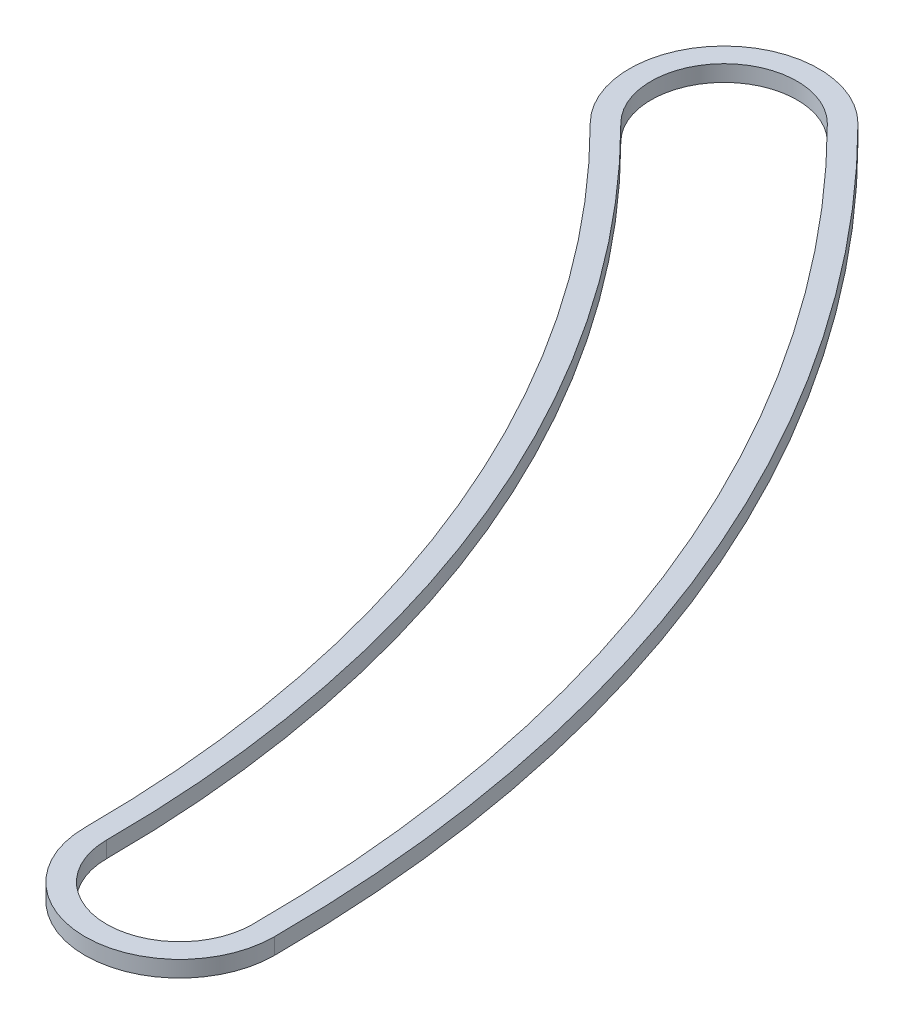
ISO-10303-21;
HEADER;
FILE_DESCRIPTION(('STEP AP214'),'2;1');
FILE_NAME('part.step','',(''),(''),'','','');
FILE_SCHEMA(('AUTOMOTIVE_DESIGN { 1 0 10303 214 1 1 1 1 }'));
ENDSEC;
DATA;
#1=APPLICATION_CONTEXT('core data for automotive mechanical design processes');
#2=APPLICATION_PROTOCOL_DEFINITION('international standard','automotive_design',2000,#1);
#3=PRODUCT_CONTEXT('',#1,'mechanical');
#4=PRODUCT('Part','Part','',(#3));
#5=PRODUCT_RELATED_PRODUCT_CATEGORY('part','',(#4));
#6=PRODUCT_DEFINITION_FORMATION('','',#4);
#7=PRODUCT_DEFINITION_CONTEXT('part definition',#1,'design');
#8=PRODUCT_DEFINITION('design','',#6,#7);
#9=PRODUCT_DEFINITION_SHAPE('','',#8);
#10=(LENGTH_UNIT() NAMED_UNIT(*) SI_UNIT(.MILLI.,.METRE.));
#11=(NAMED_UNIT(*) PLANE_ANGLE_UNIT() SI_UNIT($,.RADIAN.));
#12=(NAMED_UNIT(*) SI_UNIT($,.STERADIAN.) SOLID_ANGLE_UNIT());
#13=UNCERTAINTY_MEASURE_WITH_UNIT(LENGTH_MEASURE(1.E-05),#10,'distance_accuracy_value','');
#14=(GEOMETRIC_REPRESENTATION_CONTEXT(3) GLOBAL_UNCERTAINTY_ASSIGNED_CONTEXT((#13)) GLOBAL_UNIT_ASSIGNED_CONTEXT((#10,
#11,#12)) REPRESENTATION_CONTEXT('',''));
#15=CARTESIAN_POINT('',(0.,0.,0.));
#16=DIRECTION('',(0.,0.,1.));
#17=DIRECTION('',(1.,0.,0.));
#18=AXIS2_PLACEMENT_3D('',#15,#16,#17);
#19=CARTESIAN_POINT('',(30.861,0.762,0.));
#20=DIRECTION('',(0.,1.,0.));
#21=DIRECTION('',(0.,0.,1.));
#22=AXIS2_PLACEMENT_3D('',#19,#20,#21);
#23=PLANE('',#22);
#24=CARTESIAN_POINT('',(61.722,0.762,0.));
#25=DIRECTION('',(0.,1.,0.));
#26=DIRECTION('',(0.,0.,1.));
#27=AXIS2_PLACEMENT_3D('',#24,#25,#26);
#28=CIRCLE('',#27,4.445);
#29=CARTESIAN_POINT('',(57.277,0.762,0.));
#30=VERTEX_POINT('',#29);
#31=CARTESIAN_POINT('',(66.167,0.762,0.));
#32=VERTEX_POINT('',#31);
#33=EDGE_CURVE('E153',#30,#32,#28,.T.);
#34=ORIENTED_EDGE('',*,*,#33,.T.);
#35=CARTESIAN_POINT('',(0.,0.762,0.));
#36=DIRECTION('',(0.,1.,0.));
#37=DIRECTION('',(0.,0.,1.));
#38=AXIS2_PLACEMENT_3D('',#35,#36,#37);
#39=CIRCLE('',#38,66.167);
#40=CARTESIAN_POINT('',(46.7871343907702,0.762,-46.7871343907704));
#41=VERTEX_POINT('',#40);
#42=EDGE_CURVE('E157',#32,#41,#39,.T.);
#43=ORIENTED_EDGE('',*,*,#42,.T.);
#44=CARTESIAN_POINT('',(43.644044748396,0.762,-43.6440447483962));
#45=DIRECTION('',(0.,1.,0.));
#46=DIRECTION('',(0.,0.,1.));
#47=AXIS2_PLACEMENT_3D('',#44,#45,#46);
#48=CIRCLE('',#47,4.445);
#49=CARTESIAN_POINT('',(40.5009551060218,0.762,-40.500955106022));
#50=VERTEX_POINT('',#49);
#51=EDGE_CURVE('E161',#41,#50,#48,.T.);
#52=ORIENTED_EDGE('',*,*,#51,.T.);
#53=CARTESIAN_POINT('',(0.,0.762,0.));
#54=DIRECTION('',(0.,-1.,0.));
#55=DIRECTION('',(0.,0.,1.));
#56=AXIS2_PLACEMENT_3D('',#53,#54,#55);
#57=CIRCLE('',#56,57.277);
#58=EDGE_CURVE('E164',#50,#30,#57,.T.);
#59=ORIENTED_EDGE('',*,*,#58,.T.);
#60=EDGE_LOOP('',(#34,#43,#52,#59));
#61=FACE_BOUND('',#60,.T.);
#62=CARTESIAN_POINT('',(0.,0.762,0.));
#63=DIRECTION('',(0.,1.,0.));
#64=DIRECTION('',(0.,0.,1.));
#65=AXIS2_PLACEMENT_3D('',#62,#63,#64);
#66=CIRCLE('',#65,65.151);
#67=CARTESIAN_POINT('',(65.151,0.762,0.));
#68=VERTEX_POINT('',#67);
#69=CARTESIAN_POINT('',(46.0687139010846,0.762,-46.0687139010848));
#70=VERTEX_POINT('',#69);
#71=EDGE_CURVE('E114',#68,#70,#66,.T.);
#72=ORIENTED_EDGE('',*,*,#71,.F.);
#73=CARTESIAN_POINT('',(61.722,0.762,0.));
#74=DIRECTION('',(0.,1.,0.));
#75=DIRECTION('',(0.,0.,1.));
#76=AXIS2_PLACEMENT_3D('',#73,#74,#75);
#77=CIRCLE('',#76,3.429);
#78=CARTESIAN_POINT('',(58.293,0.762,0.));
#79=VERTEX_POINT('',#78);
#80=EDGE_CURVE('E105',#79,#68,#77,.T.);
#81=ORIENTED_EDGE('',*,*,#80,.F.);
#82=CARTESIAN_POINT('',(0.,0.762,0.));
#83=DIRECTION('',(0.,-1.,0.));
#84=DIRECTION('',(0.,0.,1.));
#85=AXIS2_PLACEMENT_3D('',#82,#83,#84);
#86=CIRCLE('',#85,58.293);
#87=CARTESIAN_POINT('',(41.2193755957073,0.762,-41.2193755957075));
#88=VERTEX_POINT('',#87);
#89=EDGE_CURVE('E131',#88,#79,#86,.T.);
#90=ORIENTED_EDGE('',*,*,#89,.F.);
#91=CARTESIAN_POINT('',(43.644044748396,0.762,-43.6440447483962));
#92=DIRECTION('',(0.,1.,0.));
#93=DIRECTION('',(0.,0.,1.));
#94=AXIS2_PLACEMENT_3D('',#91,#92,#93);
#95=CIRCLE('',#94,3.429);
#96=EDGE_CURVE('E127',#70,#88,#95,.T.);
#97=ORIENTED_EDGE('',*,*,#96,.F.);
#98=EDGE_LOOP('',(#72,#81,#90,#97));
#99=FACE_BOUND('',#98,.T.);
#100=ADVANCED_FACE('F39',(#61,#99),#23,.T.);
#101=CARTESIAN_POINT('',(30.861,0.,0.));
#102=DIRECTION('',(0.,1.,0.));
#103=DIRECTION('',(0.,0.,1.));
#104=AXIS2_PLACEMENT_3D('',#101,#102,#103);
#105=PLANE('',#104);
#106=CARTESIAN_POINT('',(61.722,0.,0.));
#107=DIRECTION('',(0.,1.,0.));
#108=DIRECTION('',(0.,0.,1.));
#109=AXIS2_PLACEMENT_3D('',#106,#107,#108);
#110=CIRCLE('',#109,4.445);
#111=CARTESIAN_POINT('',(57.277,0.,0.));
#112=VERTEX_POINT('',#111);
#113=CARTESIAN_POINT('',(66.167,0.,0.));
#114=VERTEX_POINT('',#113);
#115=EDGE_CURVE('E123',#112,#114,#110,.T.);
#116=ORIENTED_EDGE('',*,*,#115,.F.);
#117=CARTESIAN_POINT('',(0.,0.,0.));
#118=DIRECTION('',(0.,-1.,0.));
#119=DIRECTION('',(0.,0.,1.));
#120=AXIS2_PLACEMENT_3D('',#117,#118,#119);
#121=CIRCLE('',#120,57.277);
#122=CARTESIAN_POINT('',(40.5009551060218,0.,-40.500955106022));
#123=VERTEX_POINT('',#122);
#124=EDGE_CURVE('E158',#123,#112,#121,.T.);
#125=ORIENTED_EDGE('',*,*,#124,.F.);
#126=CARTESIAN_POINT('',(43.644044748396,0.,-43.6440447483962));
#127=DIRECTION('',(0.,1.,0.));
#128=DIRECTION('',(0.,0.,1.));
#129=AXIS2_PLACEMENT_3D('',#126,#127,#128);
#130=CIRCLE('',#129,4.445);
#131=CARTESIAN_POINT('',(46.7871343907702,0.,-46.7871343907704));
#132=VERTEX_POINT('',#131);
#133=EDGE_CURVE('E174',#132,#123,#130,.T.);
#134=ORIENTED_EDGE('',*,*,#133,.F.);
#135=CARTESIAN_POINT('',(0.,0.,0.));
#136=DIRECTION('',(0.,1.,0.));
#137=DIRECTION('',(0.,0.,1.));
#138=AXIS2_PLACEMENT_3D('',#135,#136,#137);
#139=CIRCLE('',#138,66.167);
#140=EDGE_CURVE('E171',#114,#132,#139,.T.);
#141=ORIENTED_EDGE('',*,*,#140,.F.);
#142=EDGE_LOOP('',(#116,#125,#134,#141));
#143=FACE_BOUND('',#142,.T.);
#144=CARTESIAN_POINT('',(61.722,0.,0.));
#145=DIRECTION('',(0.,1.,0.));
#146=DIRECTION('',(0.,0.,1.));
#147=AXIS2_PLACEMENT_3D('',#144,#145,#146);
#148=CIRCLE('',#147,3.429);
#149=CARTESIAN_POINT('',(58.293,0.,0.));
#150=VERTEX_POINT('',#149);
#151=CARTESIAN_POINT('',(65.151,0.,0.));
#152=VERTEX_POINT('',#151);
#153=EDGE_CURVE('E63',#150,#152,#148,.T.);
#154=ORIENTED_EDGE('',*,*,#153,.T.);
#155=CARTESIAN_POINT('',(0.,0.,0.));
#156=DIRECTION('',(0.,1.,0.));
#157=DIRECTION('',(0.,0.,1.));
#158=AXIS2_PLACEMENT_3D('',#155,#156,#157);
#159=CIRCLE('',#158,65.151);
#160=CARTESIAN_POINT('',(46.0687139010846,0.,-46.0687139010848));
#161=VERTEX_POINT('',#160);
#162=EDGE_CURVE('E121',#152,#161,#159,.T.);
#163=ORIENTED_EDGE('',*,*,#162,.T.);
#164=CARTESIAN_POINT('',(43.644044748396,0.,-43.6440447483962));
#165=DIRECTION('',(0.,1.,0.));
#166=DIRECTION('',(0.,0.,1.));
#167=AXIS2_PLACEMENT_3D('',#164,#165,#166);
#168=CIRCLE('',#167,3.429);
#169=CARTESIAN_POINT('',(41.2193755957073,0.,-41.2193755957075));
#170=VERTEX_POINT('',#169);
#171=EDGE_CURVE('E140',#161,#170,#168,.T.);
#172=ORIENTED_EDGE('',*,*,#171,.T.);
#173=CARTESIAN_POINT('',(0.,0.,0.));
#174=DIRECTION('',(0.,-1.,0.));
#175=DIRECTION('',(0.,0.,1.));
#176=AXIS2_PLACEMENT_3D('',#173,#174,#175);
#177=CIRCLE('',#176,58.293);
#178=EDGE_CURVE('E115',#170,#150,#177,.T.);
#179=ORIENTED_EDGE('',*,*,#178,.T.);
#180=EDGE_LOOP('',(#154,#163,#172,#179));
#181=FACE_BOUND('',#180,.T.);
#182=ADVANCED_FACE('F197',(#143,#181),#105,.F.);
#183=CARTESIAN_POINT('',(61.722,0.762,0.));
#184=DIRECTION('',(0.,-1.,0.));
#185=DIRECTION('',(0.,0.,-1.));
#186=AXIS2_PLACEMENT_3D('',#183,#184,#185);
#187=CYLINDRICAL_SURFACE('',#186,4.445);
#188=ORIENTED_EDGE('',*,*,#115,.T.);
#189=DIRECTION('',(0.,-1.,0.));
#190=VECTOR('',#189,1.);
#191=CARTESIAN_POINT('',(66.167,0.762,0.));
#192=LINE('',#191,#190);
#193=EDGE_CURVE('E11',#32,#114,#192,.T.);
#194=ORIENTED_EDGE('',*,*,#193,.F.);
#195=ORIENTED_EDGE('',*,*,#33,.F.);
#196=DIRECTION('',(0.,-1.,0.));
#197=VECTOR('',#196,1.);
#198=CARTESIAN_POINT('',(57.277,0.762,0.));
#199=LINE('',#198,#197);
#200=EDGE_CURVE('E167',#30,#112,#199,.T.);
#201=ORIENTED_EDGE('',*,*,#200,.T.);
#202=EDGE_LOOP('',(#188,#194,#195,#201));
#203=FACE_BOUND('',#202,.T.);
#204=ADVANCED_FACE('F41',(#203),#187,.T.);
#205=CARTESIAN_POINT('',(0.,0.762,0.));
#206=DIRECTION('',(0.,-1.,0.));
#207=DIRECTION('',(0.,0.,-1.));
#208=AXIS2_PLACEMENT_3D('',#205,#206,#207);
#209=CYLINDRICAL_SURFACE('',#208,66.167);
#210=ORIENTED_EDGE('',*,*,#140,.T.);
#211=DIRECTION('',(0.,-1.,0.));
#212=VECTOR('',#211,1.);
#213=CARTESIAN_POINT('',(46.7871343907702,0.762,-46.7871343907704));
#214=LINE('',#213,#212);
#215=EDGE_CURVE('E48',#41,#132,#214,.T.);
#216=ORIENTED_EDGE('',*,*,#215,.F.);
#217=ORIENTED_EDGE('',*,*,#42,.F.);
#218=ORIENTED_EDGE('',*,*,#193,.T.);
#219=EDGE_LOOP('',(#210,#216,#217,#218));
#220=FACE_BOUND('',#219,.T.);
#221=ADVANCED_FACE('F207',(#220),#209,.T.);
#222=CARTESIAN_POINT('',(43.644044748396,0.762,-43.6440447483962));
#223=DIRECTION('',(0.,-1.,0.));
#224=DIRECTION('',(0.,0.,-1.));
#225=AXIS2_PLACEMENT_3D('',#222,#223,#224);
#226=CYLINDRICAL_SURFACE('',#225,4.445);
#227=ORIENTED_EDGE('',*,*,#133,.T.);
#228=DIRECTION('',(0.,-1.,0.));
#229=VECTOR('',#228,1.);
#230=CARTESIAN_POINT('',(40.5009551060218,0.762,-40.500955106022));
#231=LINE('',#230,#229);
#232=EDGE_CURVE('E182',#50,#123,#231,.T.);
#233=ORIENTED_EDGE('',*,*,#232,.F.);
#234=ORIENTED_EDGE('',*,*,#51,.F.);
#235=ORIENTED_EDGE('',*,*,#215,.T.);
#236=EDGE_LOOP('',(#227,#233,#234,#235));
#237=FACE_BOUND('',#236,.T.);
#238=ADVANCED_FACE('F191',(#237),#226,.T.);
#239=CARTESIAN_POINT('',(0.,0.762,0.));
#240=DIRECTION('',(0.,-1.,0.));
#241=DIRECTION('',(0.,0.,-1.));
#242=AXIS2_PLACEMENT_3D('',#239,#240,#241);
#243=CYLINDRICAL_SURFACE('',#242,57.277);
#244=ORIENTED_EDGE('',*,*,#124,.T.);
#245=ORIENTED_EDGE('',*,*,#200,.F.);
#246=ORIENTED_EDGE('',*,*,#58,.F.);
#247=ORIENTED_EDGE('',*,*,#232,.T.);
#248=EDGE_LOOP('',(#244,#245,#246,#247));
#249=FACE_BOUND('',#248,.T.);
#250=ADVANCED_FACE('F201',(#249),#243,.F.);
#251=CARTESIAN_POINT('',(61.722,0.762,0.));
#252=DIRECTION('',(0.,-1.,0.));
#253=DIRECTION('',(0.,0.,-1.));
#254=AXIS2_PLACEMENT_3D('',#251,#252,#253);
#255=CYLINDRICAL_SURFACE('',#254,3.429);
#256=ORIENTED_EDGE('',*,*,#153,.F.);
#257=DIRECTION('',(0.,-1.,0.));
#258=VECTOR('',#257,1.);
#259=CARTESIAN_POINT('',(58.293,0.762,0.));
#260=LINE('',#259,#258);
#261=EDGE_CURVE('E109',#79,#150,#260,.T.);
#262=ORIENTED_EDGE('',*,*,#261,.F.);
#263=ORIENTED_EDGE('',*,*,#80,.T.);
#264=DIRECTION('',(0.,-1.,0.));
#265=VECTOR('',#264,1.);
#266=CARTESIAN_POINT('',(65.151,0.762,0.));
#267=LINE('',#266,#265);
#268=EDGE_CURVE('E108',#68,#152,#267,.T.);
#269=ORIENTED_EDGE('',*,*,#268,.T.);
#270=EDGE_LOOP('',(#256,#262,#263,#269));
#271=FACE_BOUND('',#270,.T.);
#272=ADVANCED_FACE('F107',(#271),#255,.F.);
#273=CARTESIAN_POINT('',(0.,0.762,0.));
#274=DIRECTION('',(0.,-1.,0.));
#275=DIRECTION('',(0.,0.,-1.));
#276=AXIS2_PLACEMENT_3D('',#273,#274,#275);
#277=CYLINDRICAL_SURFACE('',#276,65.151);
#278=ORIENTED_EDGE('',*,*,#162,.F.);
#279=ORIENTED_EDGE('',*,*,#268,.F.);
#280=ORIENTED_EDGE('',*,*,#71,.T.);
#281=DIRECTION('',(0.,-1.,0.));
#282=VECTOR('',#281,1.);
#283=CARTESIAN_POINT('',(46.0687139010846,0.762,-46.0687139010848));
#284=LINE('',#283,#282);
#285=EDGE_CURVE('E124',#70,#161,#284,.T.);
#286=ORIENTED_EDGE('',*,*,#285,.T.);
#287=EDGE_LOOP('',(#278,#279,#280,#286));
#288=FACE_BOUND('',#287,.T.);
#289=ADVANCED_FACE('F118',(#288),#277,.F.);
#290=CARTESIAN_POINT('',(43.644044748396,0.762,-43.6440447483962));
#291=DIRECTION('',(0.,-1.,0.));
#292=DIRECTION('',(0.,0.,-1.));
#293=AXIS2_PLACEMENT_3D('',#290,#291,#292);
#294=CYLINDRICAL_SURFACE('',#293,3.429);
#295=ORIENTED_EDGE('',*,*,#171,.F.);
#296=ORIENTED_EDGE('',*,*,#285,.F.);
#297=ORIENTED_EDGE('',*,*,#96,.T.);
#298=DIRECTION('',(0.,-1.,0.));
#299=VECTOR('',#298,1.);
#300=CARTESIAN_POINT('',(41.2193755957073,0.762,-41.2193755957075));
#301=LINE('',#300,#299);
#302=EDGE_CURVE('E55',#88,#170,#301,.T.);
#303=ORIENTED_EDGE('',*,*,#302,.T.);
#304=EDGE_LOOP('',(#295,#296,#297,#303));
#305=FACE_BOUND('',#304,.T.);
#306=ADVANCED_FACE('F230',(#305),#294,.F.);
#307=CARTESIAN_POINT('',(0.,0.762,0.));
#308=DIRECTION('',(0.,-1.,0.));
#309=DIRECTION('',(0.,0.,-1.));
#310=AXIS2_PLACEMENT_3D('',#307,#308,#309);
#311=CYLINDRICAL_SURFACE('',#310,58.293);
#312=ORIENTED_EDGE('',*,*,#178,.F.);
#313=ORIENTED_EDGE('',*,*,#302,.F.);
#314=ORIENTED_EDGE('',*,*,#89,.T.);
#315=ORIENTED_EDGE('',*,*,#261,.T.);
#316=EDGE_LOOP('',(#312,#313,#314,#315));
#317=FACE_BOUND('',#316,.T.);
#318=ADVANCED_FACE('F234',(#317),#311,.T.);
#319=CLOSED_SHELL('',(#100,#182,#204,#221,#238,#250,#272,#289,#306,#318));
#320=MANIFOLD_SOLID_BREP('B2',#319);
#321=ADVANCED_BREP_SHAPE_REPRESENTATION('',(#18,#320),#14);
#322=SHAPE_DEFINITION_REPRESENTATION(#9,#321);
ENDSEC;
END-ISO-10303-21;
